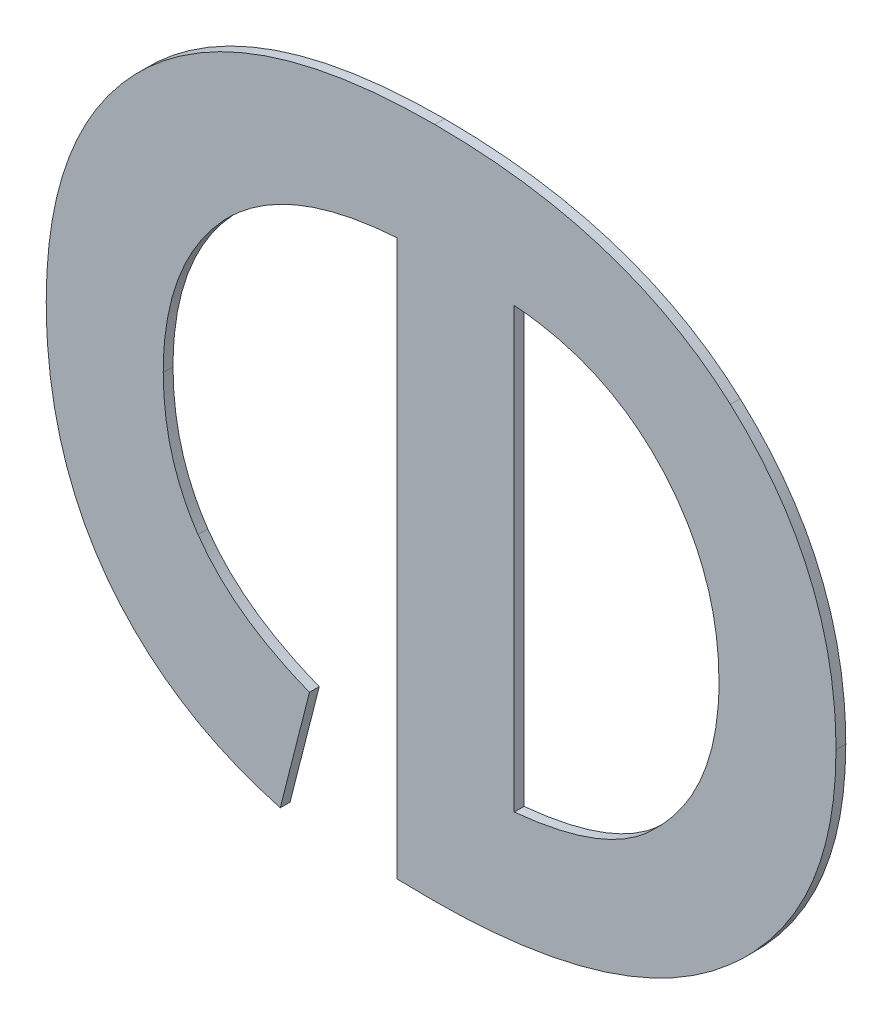
ISO-10303-21;
HEADER;
FILE_DESCRIPTION(('STEP AP214'),'2;1');
FILE_NAME('part.step','',(''),(''),'','','');
FILE_SCHEMA(('AUTOMOTIVE_DESIGN { 1 0 10303 214 1 1 1 1 }'));
ENDSEC;
DATA;
#1=APPLICATION_CONTEXT('core data for automotive mechanical design processes');
#2=APPLICATION_PROTOCOL_DEFINITION('international standard','automotive_design',2000,#1);
#3=PRODUCT_CONTEXT('',#1,'mechanical');
#4=PRODUCT('Part','Part','',(#3));
#5=PRODUCT_RELATED_PRODUCT_CATEGORY('part','',(#4));
#6=PRODUCT_DEFINITION_FORMATION('','',#4);
#7=PRODUCT_DEFINITION_CONTEXT('part definition',#1,'design');
#8=PRODUCT_DEFINITION('design','',#6,#7);
#9=PRODUCT_DEFINITION_SHAPE('','',#8);
#10=(LENGTH_UNIT() NAMED_UNIT(*) SI_UNIT(.MILLI.,.METRE.));
#11=(NAMED_UNIT(*) PLANE_ANGLE_UNIT() SI_UNIT($,.RADIAN.));
#12=(NAMED_UNIT(*) SI_UNIT($,.STERADIAN.) SOLID_ANGLE_UNIT());
#13=UNCERTAINTY_MEASURE_WITH_UNIT(LENGTH_MEASURE(1.E-05),#10,'distance_accuracy_value','');
#14=(GEOMETRIC_REPRESENTATION_CONTEXT(3) GLOBAL_UNCERTAINTY_ASSIGNED_CONTEXT((#13)) GLOBAL_UNIT_ASSIGNED_CONTEXT((#10,
#11,#12)) REPRESENTATION_CONTEXT('',''));
#15=CARTESIAN_POINT('',(0.,0.,0.));
#16=DIRECTION('',(0.,0.,1.));
#17=DIRECTION('',(1.,0.,0.));
#18=AXIS2_PLACEMENT_3D('',#15,#16,#17);
#19=CARTESIAN_POINT('',(1.095228086098,1.2951719650312,1.7496000059366));
#20=DIRECTION('',(0.968996414651314,-0.247074782996766,0.));
#21=DIRECTION('',(0.,0.,-1.));
#22=AXIS2_PLACEMENT_3D('',#19,#20,#21);
#23=PLANE('',#22);
#24=DIRECTION('',(0.,0.,1.));
#25=VECTOR('',#24,1.);
#26=CARTESIAN_POINT('',(1.0958259629557,1.2975167633327,1.7492000059366));
#27=LINE('',#26,#25);
#28=CARTESIAN_POINT('',(1.0958259629557,1.2975167633327,1.7492000059366));
#29=VERTEX_POINT('',#28);
#30=CARTESIAN_POINT('',(1.0958259629557,1.2975167633327,1.7496000059366));
#31=VERTEX_POINT('',#30);
#32=EDGE_CURVE('E11',#29,#31,#27,.T.);
#33=ORIENTED_EDGE('',*,*,#32,.T.);
#34=DIRECTION('',(-0.247074782996766,-0.968996414651314,0.));
#35=VECTOR('',#34,1.);
#36=CARTESIAN_POINT('',(1.0958259629557,1.2975167633327,1.7496000059366));
#37=LINE('',#36,#35);
#38=CARTESIAN_POINT('',(1.0946302092403,1.2928271667297,1.7496000059366));
#39=VERTEX_POINT('',#38);
#40=EDGE_CURVE('E24',#31,#39,#37,.T.);
#41=ORIENTED_EDGE('',*,*,#40,.T.);
#42=DIRECTION('',(0.,0.,1.));
#43=VECTOR('',#42,1.);
#44=CARTESIAN_POINT('',(1.0946302092403,1.2928271667297,1.7492000059366));
#45=LINE('',#44,#43);
#46=CARTESIAN_POINT('',(1.0946302092403,1.2928271667297,1.7492000059366));
#47=VERTEX_POINT('',#46);
#48=EDGE_CURVE('E482',#47,#39,#45,.T.);
#49=ORIENTED_EDGE('',*,*,#48,.F.);
#50=DIRECTION('',(-0.247074782996766,-0.968996414651314,0.));
#51=VECTOR('',#50,1.);
#52=CARTESIAN_POINT('',(1.0958259629557,1.2975167633327,1.7492000059366));
#53=LINE('',#52,#51);
#54=EDGE_CURVE('E476',#29,#47,#53,.T.);
#55=ORIENTED_EDGE('',*,*,#54,.F.);
#56=EDGE_LOOP('',(#33,#41,#49,#55));
#57=FACE_BOUND('',#56,.T.);
#58=ADVANCED_FACE('F17',(#57),#23,.T.);
#59=CARTESIAN_POINT('',(1.0946302092403,1.2928271667297,1.7496000059366));
#60=CARTESIAN_POINT('',(1.0946302092403,1.2928271667297,1.7491200059366));
#61=CARTESIAN_POINT('',(1.0900900818517,1.2940602877489,1.7496000059366));
#62=CARTESIAN_POINT('',(1.0900900818517,1.2940602877489,1.7491200059366));
#63=CARTESIAN_POINT('',(1.0875677888581,1.2974046614219,1.7496000059366));
#64=CARTESIAN_POINT('',(1.0875677888581,1.2974046614219,1.7491200059366));
#65=B_SPLINE_SURFACE_WITH_KNOTS('',2,1,((#59,#60),(#61,#62),(#63,#64)),.UNSPECIFIED.,.F.,.F.,
.F.,(3,3),(2,2),(0.,1.),(0.,0.000239999999999974),.UNSPECIFIED.);
#66=CARTESIAN_POINT('',(1.0946302092403,1.2928271667297,1.7496000059366));
#67=CARTESIAN_POINT('',(1.0900900818517,1.2940602877489,1.7496000059366));
#68=CARTESIAN_POINT('',(1.0875677888581,1.2974046614219,1.7496000059366));
#69=B_SPLINE_CURVE_WITH_KNOTS('',2,(#66,#67,#68),.UNSPECIFIED.,.F.,.F.,(3,3),(0.,1.),.UNSPECIFIED.);
#70=CARTESIAN_POINT('',(1.0875677888581,1.2974046614219,1.7496000059366));
#71=VERTEX_POINT('',#70);
#72=EDGE_CURVE('E472',#39,#71,#69,.T.);
#73=DIRECTION('',(0.,0.,1.));
#74=VECTOR('',#73,1.);
#75=CARTESIAN_POINT('',(1.0875677888581,1.2974046614219,1.7492000059366));
#76=LINE('',#75,#74);
#77=CARTESIAN_POINT('',(1.0875677888581,1.2974046614219,1.7492000059366));
#78=VERTEX_POINT('',#77);
#79=EDGE_CURVE('E466',#78,#71,#76,.T.);
#80=CARTESIAN_POINT('',(1.0946302092403,1.2928271667297,1.7492000059366));
#81=CARTESIAN_POINT('',(1.0900900818517,1.2940602877489,1.7492000059366));
#82=CARTESIAN_POINT('',(1.0875677888581,1.2974046614219,1.7492000059366));
#83=B_SPLINE_CURVE_WITH_KNOTS('',2,(#80,#81,#82),.UNSPECIFIED.,.F.,.F.,(3,3),(0.,1.),.UNSPECIFIED.);
#84=EDGE_CURVE('E458',#47,#78,#83,.T.);
#85=ORIENTED_EDGE('',*,*,#48,.T.);
#86=ORIENTED_EDGE('',*,*,#72,.T.);
#87=ORIENTED_EDGE('',*,*,#79,.F.);
#88=ORIENTED_EDGE('',*,*,#84,.F.);
#89=EDGE_LOOP('',(#85,#86,#87,#88));
#90=FACE_BOUND('',#89,.T.);
#91=ADVANCED_FACE('F489',(#90),#65,.T.);
#92=CARTESIAN_POINT('',(1.0875677888581,1.2974046614219,1.7496000059366));
#93=CARTESIAN_POINT('',(1.0875677888581,1.2974046614219,1.7491200059366));
#94=CARTESIAN_POINT('',(1.0850641795163,1.3007490350949,1.7496000059366));
#95=CARTESIAN_POINT('',(1.0850641795163,1.3007490350949,1.7491200059366));
#96=CARTESIAN_POINT('',(1.0850641795163,1.3059617739485,1.7496000059366));
#97=CARTESIAN_POINT('',(1.0850641795163,1.3059617739485,1.7491200059366));
#98=B_SPLINE_SURFACE_WITH_KNOTS('',2,1,((#92,#93),(#94,#95),(#96,#97)),.UNSPECIFIED.,.F.,.F.,
.F.,(3,3),(2,2),(0.,1.),(0.,0.000239999999999974),.UNSPECIFIED.);
#99=CARTESIAN_POINT('',(1.0875677888581,1.2974046614219,1.7496000059366));
#100=CARTESIAN_POINT('',(1.0850641795163,1.3007490350949,1.7496000059366));
#101=CARTESIAN_POINT('',(1.0850641795163,1.3059617739485,1.7496000059366));
#102=B_SPLINE_CURVE_WITH_KNOTS('',2,(#99,#100,#101),.UNSPECIFIED.,.F.,.F.,(3,3),(0.,1.),.UNSPECIFIED.);
#103=CARTESIAN_POINT('',(1.0850641795163,1.3059617739485,1.7496000059366));
#104=VERTEX_POINT('',#103);
#105=EDGE_CURVE('E454',#71,#104,#102,.T.);
#106=DIRECTION('',(0.,0.,1.));
#107=VECTOR('',#106,1.);
#108=CARTESIAN_POINT('',(1.0850641795163,1.3059617739485,1.7492000059366));
#109=LINE('',#108,#107);
#110=CARTESIAN_POINT('',(1.0850641795163,1.3059617739485,1.7492000059366));
#111=VERTEX_POINT('',#110);
#112=EDGE_CURVE('E448',#111,#104,#109,.T.);
#113=CARTESIAN_POINT('',(1.0875677888581,1.2974046614219,1.7492000059366));
#114=CARTESIAN_POINT('',(1.0850641795163,1.3007490350949,1.7492000059366));
#115=CARTESIAN_POINT('',(1.0850641795163,1.3059617739485,1.7492000059366));
#116=B_SPLINE_CURVE_WITH_KNOTS('',2,(#113,#114,#115),.UNSPECIFIED.,.F.,.F.,(3,3),(0.,1.),.UNSPECIFIED.);
#117=EDGE_CURVE('E440',#78,#111,#116,.T.);
#118=ORIENTED_EDGE('',*,*,#79,.T.);
#119=ORIENTED_EDGE('',*,*,#105,.T.);
#120=ORIENTED_EDGE('',*,*,#112,.F.);
#121=ORIENTED_EDGE('',*,*,#117,.F.);
#122=EDGE_LOOP('',(#118,#119,#120,#121));
#123=FACE_BOUND('',#122,.T.);
#124=ADVANCED_FACE('F496',(#123),#98,.T.);
#125=CARTESIAN_POINT('',(1.0850641795163,1.3059617739485,1.7496000059366));
#126=CARTESIAN_POINT('',(1.0850641795163,1.3059617739485,1.7491200059366));
#127=CARTESIAN_POINT('',(1.0850641795163,1.3125010520801,1.7496000059366));
#128=CARTESIAN_POINT('',(1.0850641795163,1.3125010520801,1.7491200059366));
#129=CARTESIAN_POINT('',(1.0892306338687,1.3163498843519,1.7496000059366));
#130=CARTESIAN_POINT('',(1.0892306338687,1.3163498843519,1.7491200059366));
#131=B_SPLINE_SURFACE_WITH_KNOTS('',2,1,((#125,#126),(#127,#128),(#129,#130)),.UNSPECIFIED.,.F.,
.F.,.F.,(3,3),(2,2),(0.,1.),(0.,0.000239999999999974),.UNSPECIFIED.);
#132=CARTESIAN_POINT('',(1.0850641795163,1.3059617739485,1.7496000059366));
#133=CARTESIAN_POINT('',(1.0850641795163,1.3125010520801,1.7496000059366));
#134=CARTESIAN_POINT('',(1.0892306338687,1.3163498843519,1.7496000059366));
#135=B_SPLINE_CURVE_WITH_KNOTS('',2,(#132,#133,#134),.UNSPECIFIED.,.F.,.F.,(3,3),(0.,1.),.UNSPECIFIED.);
#136=CARTESIAN_POINT('',(1.0892306338687,1.3163498843519,1.7496000059366));
#137=VERTEX_POINT('',#136);
#138=EDGE_CURVE('E436',#104,#137,#135,.T.);
#139=DIRECTION('',(0.,0.,1.));
#140=VECTOR('',#139,1.);
#141=CARTESIAN_POINT('',(1.0892306338687,1.3163498843519,1.7492000059366));
#142=LINE('',#141,#140);
#143=CARTESIAN_POINT('',(1.0892306338687,1.3163498843519,1.7492000059366));
#144=VERTEX_POINT('',#143);
#145=EDGE_CURVE('E430',#144,#137,#142,.T.);
#146=CARTESIAN_POINT('',(1.0850641795163,1.3059617739485,1.7492000059366));
#147=CARTESIAN_POINT('',(1.0850641795163,1.3125010520801,1.7492000059366));
#148=CARTESIAN_POINT('',(1.0892306338687,1.3163498843519,1.7492000059366));
#149=B_SPLINE_CURVE_WITH_KNOTS('',2,(#146,#147,#148),.UNSPECIFIED.,.F.,.F.,(3,3),(0.,1.),.UNSPECIFIED.);
#150=EDGE_CURVE('E422',#111,#144,#149,.T.);
#151=ORIENTED_EDGE('',*,*,#112,.T.);
#152=ORIENTED_EDGE('',*,*,#138,.T.);
#153=ORIENTED_EDGE('',*,*,#145,.F.);
#154=ORIENTED_EDGE('',*,*,#150,.F.);
#155=EDGE_LOOP('',(#151,#152,#153,#154));
#156=FACE_BOUND('',#155,.T.);
#157=ADVANCED_FACE('F500',(#156),#131,.T.);
#158=CARTESIAN_POINT('',(1.0892306338687,1.3163498843519,1.7496000059366));
#159=CARTESIAN_POINT('',(1.0892306338687,1.3163498843519,1.7491200059366));
#160=CARTESIAN_POINT('',(1.0934157718729,1.3201800329719,1.7496000059366));
#161=CARTESIAN_POINT('',(1.0934157718729,1.3201800329719,1.7491200059366));
#162=CARTESIAN_POINT('',(1.1009452835503,1.3201800329719,1.7496000059366));
#163=CARTESIAN_POINT('',(1.1009452835503,1.3201800329719,1.7491200059366));
#164=B_SPLINE_SURFACE_WITH_KNOTS('',2,1,((#158,#159),(#160,#161),(#162,#163)),.UNSPECIFIED.,.F.,
.F.,.F.,(3,3),(2,2),(0.,1.),(0.,0.000239999999999974),.UNSPECIFIED.);
#165=CARTESIAN_POINT('',(1.0892306338687,1.3163498843519,1.7496000059366));
#166=CARTESIAN_POINT('',(1.0934157718729,1.3201800329719,1.7496000059366));
#167=CARTESIAN_POINT('',(1.1009452835503,1.3201800329719,1.7496000059366));
#168=B_SPLINE_CURVE_WITH_KNOTS('',2,(#165,#166,#167),.UNSPECIFIED.,.F.,.F.,(3,3),(0.,1.),.UNSPECIFIED.);
#169=CARTESIAN_POINT('',(1.1009452835503,1.3201800329719,1.7496000059366));
#170=VERTEX_POINT('',#169);
#171=EDGE_CURVE('E418',#137,#170,#168,.T.);
#172=DIRECTION('',(0.,0.,1.));
#173=VECTOR('',#172,1.);
#174=CARTESIAN_POINT('',(1.1009452835503,1.3201800329719,1.7492000059366));
#175=LINE('',#174,#173);
#176=CARTESIAN_POINT('',(1.1009452835503,1.3201800329719,1.7492000059366));
#177=VERTEX_POINT('',#176);
#178=EDGE_CURVE('E412',#177,#170,#175,.T.);
#179=CARTESIAN_POINT('',(1.0892306338687,1.3163498843519,1.7492000059366));
#180=CARTESIAN_POINT('',(1.0934157718729,1.3201800329719,1.7492000059366));
#181=CARTESIAN_POINT('',(1.1009452835503,1.3201800329719,1.7492000059366));
#182=B_SPLINE_CURVE_WITH_KNOTS('',2,(#179,#180,#181),.UNSPECIFIED.,.F.,.F.,(3,3),(0.,1.),.UNSPECIFIED.);
#183=EDGE_CURVE('E404',#144,#177,#182,.T.);
#184=ORIENTED_EDGE('',*,*,#145,.T.);
#185=ORIENTED_EDGE('',*,*,#171,.T.);
#186=ORIENTED_EDGE('',*,*,#178,.F.);
#187=ORIENTED_EDGE('',*,*,#183,.F.);
#188=EDGE_LOOP('',(#184,#185,#186,#187));
#189=FACE_BOUND('',#188,.T.);
#190=ADVANCED_FACE('F505',(#189),#164,.T.);
#191=CARTESIAN_POINT('',(1.1009452835503,1.3201800329719,1.7496000059366));
#192=CARTESIAN_POINT('',(1.1009452835503,1.3201800329719,1.7491200059366));
#193=CARTESIAN_POINT('',(1.1087363663529,1.3201800329719,1.7496000059366));
#194=CARTESIAN_POINT('',(1.1087363663529,1.3201800329719,1.7491200059366));
#195=CARTESIAN_POINT('',(1.1130336062679,1.3163125170483,1.7496000059366));
#196=CARTESIAN_POINT('',(1.1130336062679,1.3163125170483,1.7491200059366));
#197=B_SPLINE_SURFACE_WITH_KNOTS('',2,1,((#191,#192),(#193,#194),(#195,#196)),.UNSPECIFIED.,.F.,
.F.,.F.,(3,3),(2,2),(0.,1.),(0.,0.000239999999999974),.UNSPECIFIED.);
#198=CARTESIAN_POINT('',(1.1009452835503,1.3201800329719,1.7496000059366));
#199=CARTESIAN_POINT('',(1.1087363663529,1.3201800329719,1.7496000059366));
#200=CARTESIAN_POINT('',(1.1130336062679,1.3163125170483,1.7496000059366));
#201=B_SPLINE_CURVE_WITH_KNOTS('',2,(#198,#199,#200),.UNSPECIFIED.,.F.,.F.,(3,3),(0.,1.),.UNSPECIFIED.);
#202=CARTESIAN_POINT('',(1.1130336062679,1.3163125170483,1.7496000059366));
#203=VERTEX_POINT('',#202);
#204=EDGE_CURVE('E400',#170,#203,#201,.T.);
#205=DIRECTION('',(0.,0.,1.));
#206=VECTOR('',#205,1.);
#207=CARTESIAN_POINT('',(1.1130336062679,1.3163125170483,1.7492000059366));
#208=LINE('',#207,#206);
#209=CARTESIAN_POINT('',(1.1130336062679,1.3163125170483,1.7492000059366));
#210=VERTEX_POINT('',#209);
#211=EDGE_CURVE('E394',#210,#203,#208,.T.);
#212=CARTESIAN_POINT('',(1.1009452835503,1.3201800329719,1.7492000059366));
#213=CARTESIAN_POINT('',(1.1087363663529,1.3201800329719,1.7492000059366));
#214=CARTESIAN_POINT('',(1.1130336062679,1.3163125170483,1.7492000059366));
#215=B_SPLINE_CURVE_WITH_KNOTS('',2,(#212,#213,#214),.UNSPECIFIED.,.F.,.F.,(3,3),(0.,1.),.UNSPECIFIED.);
#216=EDGE_CURVE('E386',#177,#210,#215,.T.);
#217=ORIENTED_EDGE('',*,*,#178,.T.);
#218=ORIENTED_EDGE('',*,*,#204,.T.);
#219=ORIENTED_EDGE('',*,*,#211,.F.);
#220=ORIENTED_EDGE('',*,*,#216,.F.);
#221=EDGE_LOOP('',(#217,#218,#219,#220));
#222=FACE_BOUND('',#221,.T.);
#223=ADVANCED_FACE('F508',(#222),#197,.T.);
#224=CARTESIAN_POINT('',(1.1130336062679,1.3163125170483,1.7496000059366));
#225=CARTESIAN_POINT('',(1.1130336062679,1.3163125170483,1.7491200059366));
#226=CARTESIAN_POINT('',(1.1173495298347,1.3124263174729,1.7496000059366));
#227=CARTESIAN_POINT('',(1.1173495298347,1.3124263174729,1.7491200059366));
#228=CARTESIAN_POINT('',(1.1173495298347,1.3062420287255,1.7496000059366));
#229=CARTESIAN_POINT('',(1.1173495298347,1.3062420287255,1.7491200059366));
#230=B_SPLINE_SURFACE_WITH_KNOTS('',2,1,((#224,#225),(#226,#227),(#228,#229)),.UNSPECIFIED.,.F.,
.F.,.F.,(3,3),(2,2),(0.,1.),(0.,0.000239999999999974),.UNSPECIFIED.);
#231=CARTESIAN_POINT('',(1.1130336062679,1.3163125170483,1.7496000059366));
#232=CARTESIAN_POINT('',(1.1173495298347,1.3124263174729,1.7496000059366));
#233=CARTESIAN_POINT('',(1.1173495298347,1.3062420287255,1.7496000059366));
#234=B_SPLINE_CURVE_WITH_KNOTS('',2,(#231,#232,#233),.UNSPECIFIED.,.F.,.F.,(3,3),(0.,1.),.UNSPECIFIED.);
#235=CARTESIAN_POINT('',(1.1173495298347,1.3062420287255,1.7496000059366));
#236=VERTEX_POINT('',#235);
#237=EDGE_CURVE('E382',#203,#236,#234,.T.);
#238=DIRECTION('',(0.,0.,1.));
#239=VECTOR('',#238,1.);
#240=CARTESIAN_POINT('',(1.1173495298347,1.3062420287255,1.7492000059366));
#241=LINE('',#240,#239);
#242=CARTESIAN_POINT('',(1.1173495298347,1.3062420287255,1.7492000059366));
#243=VERTEX_POINT('',#242);
#244=EDGE_CURVE('E376',#243,#236,#241,.T.);
#245=CARTESIAN_POINT('',(1.1130336062679,1.3163125170483,1.7492000059366));
#246=CARTESIAN_POINT('',(1.1173495298347,1.3124263174729,1.7492000059366));
#247=CARTESIAN_POINT('',(1.1173495298347,1.3062420287255,1.7492000059366));
#248=B_SPLINE_CURVE_WITH_KNOTS('',2,(#245,#246,#247),.UNSPECIFIED.,.F.,.F.,(3,3),(0.,1.),.UNSPECIFIED.);
#249=EDGE_CURVE('E368',#210,#243,#248,.T.);
#250=ORIENTED_EDGE('',*,*,#211,.T.);
#251=ORIENTED_EDGE('',*,*,#237,.T.);
#252=ORIENTED_EDGE('',*,*,#244,.F.);
#253=ORIENTED_EDGE('',*,*,#249,.F.);
#254=EDGE_LOOP('',(#250,#251,#252,#253));
#255=FACE_BOUND('',#254,.T.);
#256=ADVANCED_FACE('F513',(#255),#230,.T.);
#257=CARTESIAN_POINT('',(1.1173495298347,1.3062420287255,1.7496000059366));
#258=CARTESIAN_POINT('',(1.1173495298347,1.3062420287255,1.7491200059366));
#259=CARTESIAN_POINT('',(1.1173495298347,1.3002632601481,1.7496000059366));
#260=CARTESIAN_POINT('',(1.1173495298347,1.3002632601481,1.7491200059366));
#261=CARTESIAN_POINT('',(1.1130149226161,1.2964704788317,1.7496000059366));
#262=CARTESIAN_POINT('',(1.1130149226161,1.2964704788317,1.7491200059366));
#263=B_SPLINE_SURFACE_WITH_KNOTS('',2,1,((#257,#258),(#259,#260),(#261,#262)),.UNSPECIFIED.,.F.,
.F.,.F.,(3,3),(2,2),(0.,1.),(0.,0.000239999999999974),.UNSPECIFIED.);
#264=CARTESIAN_POINT('',(1.1173495298347,1.3062420287255,1.7496000059366));
#265=CARTESIAN_POINT('',(1.1173495298347,1.3002632601481,1.7496000059366));
#266=CARTESIAN_POINT('',(1.1130149226161,1.2964704788317,1.7496000059366));
#267=B_SPLINE_CURVE_WITH_KNOTS('',2,(#264,#265,#266),.UNSPECIFIED.,.F.,.F.,(3,3),(0.,1.),.UNSPECIFIED.);
#268=CARTESIAN_POINT('',(1.1130149226161,1.2964704788317,1.7496000059366));
#269=VERTEX_POINT('',#268);
#270=EDGE_CURVE('E364',#236,#269,#267,.T.);
#271=DIRECTION('',(0.,0.,1.));
#272=VECTOR('',#271,1.);
#273=CARTESIAN_POINT('',(1.1130149226161,1.2964704788317,1.7492000059366));
#274=LINE('',#273,#272);
#275=CARTESIAN_POINT('',(1.1130149226161,1.2964704788317,1.7492000059366));
#276=VERTEX_POINT('',#275);
#277=EDGE_CURVE('E358',#276,#269,#274,.T.);
#278=CARTESIAN_POINT('',(1.1173495298347,1.3062420287255,1.7492000059366));
#279=CARTESIAN_POINT('',(1.1173495298347,1.3002632601481,1.7492000059366));
#280=CARTESIAN_POINT('',(1.1130149226161,1.2964704788317,1.7492000059366));
#281=B_SPLINE_CURVE_WITH_KNOTS('',2,(#278,#279,#280),.UNSPECIFIED.,.F.,.F.,(3,3),(0.,1.),.UNSPECIFIED.);
#282=EDGE_CURVE('E350',#243,#276,#281,.T.);
#283=ORIENTED_EDGE('',*,*,#244,.T.);
#284=ORIENTED_EDGE('',*,*,#270,.T.);
#285=ORIENTED_EDGE('',*,*,#277,.F.);
#286=ORIENTED_EDGE('',*,*,#282,.F.);
#287=EDGE_LOOP('',(#283,#284,#285,#286));
#288=FACE_BOUND('',#287,.T.);
#289=ADVANCED_FACE('F517',(#288),#263,.T.);
#290=CARTESIAN_POINT('',(1.1130149226161,1.2964704788317,1.7496000059366));
#291=CARTESIAN_POINT('',(1.1130149226161,1.2964704788317,1.7491200059366));
#292=CARTESIAN_POINT('',(1.1086989990493,1.2926776975153,1.7496000059366));
#293=CARTESIAN_POINT('',(1.1086989990493,1.2926776975153,1.7491200059366));
#294=CARTESIAN_POINT('',(1.1008518652913,1.2926776975153,1.7496000059366));
#295=CARTESIAN_POINT('',(1.1008518652913,1.2926776975153,1.7491200059366));
#296=B_SPLINE_SURFACE_WITH_KNOTS('',2,1,((#290,#291),(#292,#293),(#294,#295)),.UNSPECIFIED.,.F.,
.F.,.F.,(3,3),(2,2),(0.,1.),(0.,0.000239999999999974),.UNSPECIFIED.);
#297=CARTESIAN_POINT('',(1.1130149226161,1.2964704788317,1.7496000059366));
#298=CARTESIAN_POINT('',(1.1086989990493,1.2926776975153,1.7496000059366));
#299=CARTESIAN_POINT('',(1.1008518652913,1.2926776975153,1.7496000059366));
#300=B_SPLINE_CURVE_WITH_KNOTS('',2,(#297,#298,#299),.UNSPECIFIED.,.F.,.F.,(3,3),(0.,1.),.UNSPECIFIED.);
#301=CARTESIAN_POINT('',(1.1008518652913,1.2926776975153,1.7496000059366));
#302=VERTEX_POINT('',#301);
#303=EDGE_CURVE('E346',#269,#302,#300,.T.);
#304=DIRECTION('',(0.,0.,1.));
#305=VECTOR('',#304,1.);
#306=CARTESIAN_POINT('',(1.1008518652913,1.2926776975153,1.7492000059366));
#307=LINE('',#306,#305);
#308=CARTESIAN_POINT('',(1.1008518652913,1.2926776975153,1.7492000059366));
#309=VERTEX_POINT('',#308);
#310=EDGE_CURVE('E340',#309,#302,#307,.T.);
#311=CARTESIAN_POINT('',(1.1130149226161,1.2964704788317,1.7492000059366));
#312=CARTESIAN_POINT('',(1.1086989990493,1.2926776975153,1.7492000059366));
#313=CARTESIAN_POINT('',(1.1008518652913,1.2926776975153,1.7492000059366));
#314=B_SPLINE_CURVE_WITH_KNOTS('',2,(#311,#312,#313),.UNSPECIFIED.,.F.,.F.,(3,3),(0.,1.),.UNSPECIFIED.);
#315=EDGE_CURVE('E332',#276,#309,#314,.T.);
#316=ORIENTED_EDGE('',*,*,#277,.T.);
#317=ORIENTED_EDGE('',*,*,#303,.T.);
#318=ORIENTED_EDGE('',*,*,#310,.F.);
#319=ORIENTED_EDGE('',*,*,#315,.F.);
#320=EDGE_LOOP('',(#316,#317,#318,#319));
#321=FACE_BOUND('',#320,.T.);
#322=ADVANCED_FACE('F521',(#321),#296,.T.);
#323=CARTESIAN_POINT('',(1.1008518652913,1.2926776975153,1.7496000059366));
#324=CARTESIAN_POINT('',(1.1008518652913,1.2926776975153,1.7491200059366));
#325=CARTESIAN_POINT('',(1.1003660903443,1.2926776975153,1.7496000059366));
#326=CARTESIAN_POINT('',(1.1003660903443,1.2926776975153,1.7491200059366));
#327=CARTESIAN_POINT('',(1.0994132241023,1.2926963811671,1.7496000059366));
#328=CARTESIAN_POINT('',(1.0994132241023,1.2926963811671,1.7491200059366));
#329=B_SPLINE_SURFACE_WITH_KNOTS('',2,1,((#323,#324),(#325,#326),(#327,#328)),.UNSPECIFIED.,.F.,
.F.,.F.,(3,3),(2,2),(0.,1.),(0.,0.000239999999999974),.UNSPECIFIED.);
#330=CARTESIAN_POINT('',(1.1008518652913,1.2926776975153,1.7496000059366));
#331=CARTESIAN_POINT('',(1.1003660903443,1.2926776975153,1.7496000059366));
#332=CARTESIAN_POINT('',(1.0994132241023,1.2926963811671,1.7496000059366));
#333=B_SPLINE_CURVE_WITH_KNOTS('',2,(#330,#331,#332),.UNSPECIFIED.,.F.,.F.,(3,3),(0.,1.),.UNSPECIFIED.);
#334=CARTESIAN_POINT('',(1.0994132241023,1.2926963811671,1.7496000059366));
#335=VERTEX_POINT('',#334);
#336=EDGE_CURVE('E328',#302,#335,#333,.T.);
#337=DIRECTION('',(0.,0.,1.));
#338=VECTOR('',#337,1.);
#339=CARTESIAN_POINT('',(1.0994132241023,1.2926963811671,1.7492000059366));
#340=LINE('',#339,#338);
#341=CARTESIAN_POINT('',(1.0994132241023,1.2926963811671,1.7492000059366));
#342=VERTEX_POINT('',#341);
#343=EDGE_CURVE('E322',#342,#335,#340,.T.);
#344=CARTESIAN_POINT('',(1.1008518652913,1.2926776975153,1.7492000059366));
#345=CARTESIAN_POINT('',(1.1003660903443,1.2926776975153,1.7492000059366));
#346=CARTESIAN_POINT('',(1.0994132241023,1.2926963811671,1.7492000059366));
#347=B_SPLINE_CURVE_WITH_KNOTS('',2,(#344,#345,#346),.UNSPECIFIED.,.F.,.F.,(3,3),(0.,1.),.UNSPECIFIED.);
#348=EDGE_CURVE('E317',#309,#342,#347,.T.);
#349=ORIENTED_EDGE('',*,*,#310,.T.);
#350=ORIENTED_EDGE('',*,*,#336,.T.);
#351=ORIENTED_EDGE('',*,*,#343,.F.);
#352=ORIENTED_EDGE('',*,*,#348,.F.);
#353=EDGE_LOOP('',(#349,#350,#351,#352));
#354=FACE_BOUND('',#353,.T.);
#355=ADVANCED_FACE('F524',(#354),#329,.T.);
#356=CARTESIAN_POINT('',(1.0994132241023,1.3040466996385,1.7496000059366));
#357=DIRECTION('',(-1.,0.,0.));
#358=DIRECTION('',(0.,0.,1.));
#359=AXIS2_PLACEMENT_3D('',#356,#357,#358);
#360=PLANE('',#359);
#361=ORIENTED_EDGE('',*,*,#343,.T.);
#362=DIRECTION('',(0.,1.,0.));
#363=VECTOR('',#362,1.);
#364=CARTESIAN_POINT('',(1.0994132241023,1.2926963811671,1.7496000059366));
#365=LINE('',#364,#363);
#366=CARTESIAN_POINT('',(1.0994132241023,1.3153970181099,1.7496000059366));
#367=VERTEX_POINT('',#366);
#368=EDGE_CURVE('E315',#335,#367,#365,.T.);
#369=ORIENTED_EDGE('',*,*,#368,.T.);
#370=DIRECTION('',(0.,0.,1.));
#371=VECTOR('',#370,1.);
#372=CARTESIAN_POINT('',(1.0994132241023,1.3153970181099,1.7492000059366));
#373=LINE('',#372,#371);
#374=CARTESIAN_POINT('',(1.0994132241023,1.3153970181099,1.7492000059366));
#375=VERTEX_POINT('',#374);
#376=EDGE_CURVE('E312',#375,#367,#373,.T.);
#377=ORIENTED_EDGE('',*,*,#376,.F.);
#378=DIRECTION('',(0.,1.,0.));
#379=VECTOR('',#378,1.);
#380=CARTESIAN_POINT('',(1.0994132241023,1.2926963811671,1.7492000059366));
#381=LINE('',#380,#379);
#382=EDGE_CURVE('E306',#342,#375,#381,.T.);
#383=ORIENTED_EDGE('',*,*,#382,.F.);
#384=EDGE_LOOP('',(#361,#369,#377,#383));
#385=FACE_BOUND('',#384,.T.);
#386=ADVANCED_FACE('F529',(#385),#360,.T.);
#387=CARTESIAN_POINT('',(1.0994132241023,1.3153970181099,1.7496000059366));
#388=CARTESIAN_POINT('',(1.0994132241023,1.3153970181099,1.7491200059366));
#389=CARTESIAN_POINT('',(1.0947796784547,1.3150980796809,1.7496000059366));
#390=CARTESIAN_POINT('',(1.0947796784547,1.3150980796809,1.7491200059366));
#391=CARTESIAN_POINT('',(1.0923134364165,1.3124636847765,1.7496000059366));
#392=CARTESIAN_POINT('',(1.0923134364165,1.3124636847765,1.7491200059366));
#393=B_SPLINE_SURFACE_WITH_KNOTS('',2,1,((#387,#388),(#389,#390),(#391,#392)),.UNSPECIFIED.,.F.,
.F.,.F.,(3,3),(2,2),(0.,1.),(0.,0.000239999999999974),.UNSPECIFIED.);
#394=CARTESIAN_POINT('',(1.0994132241023,1.3153970181099,1.7496000059366));
#395=CARTESIAN_POINT('',(1.0947796784547,1.3150980796809,1.7496000059366));
#396=CARTESIAN_POINT('',(1.0923134364165,1.3124636847765,1.7496000059366));
#397=B_SPLINE_CURVE_WITH_KNOTS('',2,(#394,#395,#396),.UNSPECIFIED.,.F.,.F.,(3,3),(0.,1.),.UNSPECIFIED.);
#398=CARTESIAN_POINT('',(1.0923134364165,1.3124636847765,1.7496000059366));
#399=VERTEX_POINT('',#398);
#400=EDGE_CURVE('E302',#367,#399,#397,.T.);
#401=DIRECTION('',(0.,0.,1.));
#402=VECTOR('',#401,1.);
#403=CARTESIAN_POINT('',(1.0923134364165,1.3124636847765,1.7492000059366));
#404=LINE('',#403,#402);
#405=CARTESIAN_POINT('',(1.0923134364165,1.3124636847765,1.7492000059366));
#406=VERTEX_POINT('',#405);
#407=EDGE_CURVE('E296',#406,#399,#404,.T.);
#408=CARTESIAN_POINT('',(1.0994132241023,1.3153970181099,1.7492000059366));
#409=CARTESIAN_POINT('',(1.0947796784547,1.3150980796809,1.7492000059366));
#410=CARTESIAN_POINT('',(1.0923134364165,1.3124636847765,1.7492000059366));
#411=B_SPLINE_CURVE_WITH_KNOTS('',2,(#408,#409,#410),.UNSPECIFIED.,.F.,.F.,(3,3),(0.,1.),.UNSPECIFIED.);
#412=EDGE_CURVE('E288',#375,#406,#411,.T.);
#413=ORIENTED_EDGE('',*,*,#376,.T.);
#414=ORIENTED_EDGE('',*,*,#400,.T.);
#415=ORIENTED_EDGE('',*,*,#407,.F.);
#416=ORIENTED_EDGE('',*,*,#412,.F.);
#417=EDGE_LOOP('',(#413,#414,#415,#416));
#418=FACE_BOUND('',#417,.T.);
#419=ADVANCED_FACE('F533',(#418),#393,.T.);
#420=CARTESIAN_POINT('',(1.0923134364165,1.3124636847765,1.7496000059366));
#421=CARTESIAN_POINT('',(1.0923134364165,1.3124636847765,1.7491200059366));
#422=CARTESIAN_POINT('',(1.0898471943783,1.3098106062203,1.7496000059366));
#423=CARTESIAN_POINT('',(1.0898471943783,1.3098106062203,1.7491200059366));
#424=CARTESIAN_POINT('',(1.0898471943783,1.3058496720377,1.7496000059366));
#425=CARTESIAN_POINT('',(1.0898471943783,1.3058496720377,1.7491200059366));
#426=B_SPLINE_SURFACE_WITH_KNOTS('',2,1,((#420,#421),(#422,#423),(#424,#425)),.UNSPECIFIED.,.F.,
.F.,.F.,(3,3),(2,2),(0.,1.),(0.,0.000239999999999974),.UNSPECIFIED.);
#427=CARTESIAN_POINT('',(1.0923134364165,1.3124636847765,1.7496000059366));
#428=CARTESIAN_POINT('',(1.0898471943783,1.3098106062203,1.7496000059366));
#429=CARTESIAN_POINT('',(1.0898471943783,1.3058496720377,1.7496000059366));
#430=B_SPLINE_CURVE_WITH_KNOTS('',2,(#427,#428,#429),.UNSPECIFIED.,.F.,.F.,(3,3),(0.,1.),.UNSPECIFIED.);
#431=CARTESIAN_POINT('',(1.0898471943783,1.3058496720377,1.7496000059366));
#432=VERTEX_POINT('',#431);
#433=EDGE_CURVE('E284',#399,#432,#430,.T.);
#434=DIRECTION('',(0.,0.,1.));
#435=VECTOR('',#434,1.);
#436=CARTESIAN_POINT('',(1.0898471943783,1.3058496720377,1.7492000059366));
#437=LINE('',#436,#435);
#438=CARTESIAN_POINT('',(1.0898471943783,1.3058496720377,1.7492000059366));
#439=VERTEX_POINT('',#438);
#440=EDGE_CURVE('E278',#439,#432,#437,.T.);
#441=CARTESIAN_POINT('',(1.0923134364165,1.3124636847765,1.7492000059366));
#442=CARTESIAN_POINT('',(1.0898471943783,1.3098106062203,1.7492000059366));
#443=CARTESIAN_POINT('',(1.0898471943783,1.3058496720377,1.7492000059366));
#444=B_SPLINE_CURVE_WITH_KNOTS('',2,(#441,#442,#443),.UNSPECIFIED.,.F.,.F.,(3,3),(0.,1.),.UNSPECIFIED.);
#445=EDGE_CURVE('E270',#406,#439,#444,.T.);
#446=ORIENTED_EDGE('',*,*,#407,.T.);
#447=ORIENTED_EDGE('',*,*,#433,.T.);
#448=ORIENTED_EDGE('',*,*,#440,.F.);
#449=ORIENTED_EDGE('',*,*,#445,.F.);
#450=EDGE_LOOP('',(#446,#447,#448,#449));
#451=FACE_BOUND('',#450,.T.);
#452=ADVANCED_FACE('F537',(#451),#426,.T.);
#453=CARTESIAN_POINT('',(1.0898471943783,1.3058496720377,1.7496000059366));
#454=CARTESIAN_POINT('',(1.0898471943783,1.3058496720377,1.7491200059366));
#455=CARTESIAN_POINT('',(1.0898471943783,1.3028976550525,1.7496000059366));
#456=CARTESIAN_POINT('',(1.0898471943783,1.3028976550525,1.7491200059366));
#457=CARTESIAN_POINT('',(1.0912671519155,1.3008237697021,1.7496000059366));
#458=CARTESIAN_POINT('',(1.0912671519155,1.3008237697021,1.7491200059366));
#459=B_SPLINE_SURFACE_WITH_KNOTS('',2,1,((#453,#454),(#455,#456),(#457,#458)),.UNSPECIFIED.,.F.,
.F.,.F.,(3,3),(2,2),(0.,1.),(0.,0.000239999999999974),.UNSPECIFIED.);
#460=CARTESIAN_POINT('',(1.0898471943783,1.3058496720377,1.7496000059366));
#461=CARTESIAN_POINT('',(1.0898471943783,1.3028976550525,1.7496000059366));
#462=CARTESIAN_POINT('',(1.0912671519155,1.3008237697021,1.7496000059366));
#463=B_SPLINE_CURVE_WITH_KNOTS('',2,(#460,#461,#462),.UNSPECIFIED.,.F.,.F.,(3,3),(0.,1.),.UNSPECIFIED.);
#464=CARTESIAN_POINT('',(1.0912671519155,1.3008237697021,1.7496000059366));
#465=VERTEX_POINT('',#464);
#466=EDGE_CURVE('E266',#432,#465,#463,.T.);
#467=DIRECTION('',(0.,0.,1.));
#468=VECTOR('',#467,1.);
#469=CARTESIAN_POINT('',(1.0912671519155,1.3008237697021,1.7492000059366));
#470=LINE('',#469,#468);
#471=CARTESIAN_POINT('',(1.0912671519155,1.3008237697021,1.7492000059366));
#472=VERTEX_POINT('',#471);
#473=EDGE_CURVE('E260',#472,#465,#470,.T.);
#474=CARTESIAN_POINT('',(1.0898471943783,1.3058496720377,1.7492000059366));
#475=CARTESIAN_POINT('',(1.0898471943783,1.3028976550525,1.7492000059366));
#476=CARTESIAN_POINT('',(1.0912671519155,1.3008237697021,1.7492000059366));
#477=B_SPLINE_CURVE_WITH_KNOTS('',2,(#474,#475,#476),.UNSPECIFIED.,.F.,.F.,(3,3),(0.,1.),.UNSPECIFIED.);
#478=EDGE_CURVE('E252',#439,#472,#477,.T.);
#479=ORIENTED_EDGE('',*,*,#440,.T.);
#480=ORIENTED_EDGE('',*,*,#466,.T.);
#481=ORIENTED_EDGE('',*,*,#473,.F.);
#482=ORIENTED_EDGE('',*,*,#478,.F.);
#483=EDGE_LOOP('',(#479,#480,#481,#482));
#484=FACE_BOUND('',#483,.T.);
#485=ADVANCED_FACE('F540',(#484),#459,.T.);
#486=CARTESIAN_POINT('',(1.0912671519155,1.3008237697021,1.7496000059366));
#487=CARTESIAN_POINT('',(1.0912671519155,1.3008237697021,1.7491200059366));
#488=CARTESIAN_POINT('',(1.0927057931045,1.2987312007001,1.7496000059366));
#489=CARTESIAN_POINT('',(1.0927057931045,1.2987312007001,1.7491200059366));
#490=CARTESIAN_POINT('',(1.0958259629557,1.2975167633327,1.7496000059366));
#491=CARTESIAN_POINT('',(1.0958259629557,1.2975167633327,1.7491200059366));
#492=B_SPLINE_SURFACE_WITH_KNOTS('',2,1,((#486,#487),(#488,#489),(#490,#491)),.UNSPECIFIED.,.F.,
.F.,.F.,(3,3),(2,2),(0.,1.),(0.,0.000239999999999974),.UNSPECIFIED.);
#493=CARTESIAN_POINT('',(1.0912671519155,1.3008237697021,1.7496000059366));
#494=CARTESIAN_POINT('',(1.0927057931045,1.2987312007001,1.7496000059366));
#495=CARTESIAN_POINT('',(1.0958259629557,1.2975167633327,1.7496000059366));
#496=B_SPLINE_CURVE_WITH_KNOTS('',2,(#493,#494,#495),.UNSPECIFIED.,.F.,.F.,(3,3),(0.,1.),.UNSPECIFIED.);
#497=EDGE_CURVE('E245',#465,#31,#496,.T.);
#498=CARTESIAN_POINT('',(1.0912671519155,1.3008237697021,1.7492000059366));
#499=CARTESIAN_POINT('',(1.0927057931045,1.2987312007001,1.7492000059366));
#500=CARTESIAN_POINT('',(1.0958259629557,1.2975167633327,1.7492000059366));
#501=B_SPLINE_CURVE_WITH_KNOTS('',2,(#498,#499,#500),.UNSPECIFIED.,.F.,.F.,(3,3),(0.,1.),.UNSPECIFIED.);
#502=EDGE_CURVE('E240',#472,#29,#501,.T.);
#503=ORIENTED_EDGE('',*,*,#473,.T.);
#504=ORIENTED_EDGE('',*,*,#497,.T.);
#505=ORIENTED_EDGE('',*,*,#32,.F.);
#506=ORIENTED_EDGE('',*,*,#502,.F.);
#507=EDGE_LOOP('',(#503,#504,#505,#506));
#508=FACE_BOUND('',#507,.T.);
#509=ADVANCED_FACE('F541',(#508),#492,.T.);
#510=CARTESIAN_POINT('',(1.1041962389643,1.3064288652436,1.7496000059366));
#511=DIRECTION('',(1.,0.,0.));
#512=DIRECTION('',(0.,0.,-1.));
#513=AXIS2_PLACEMENT_3D('',#510,#511,#512);
#514=PLANE('',#513);
#515=DIRECTION('',(0.,0.,1.));
#516=VECTOR('',#515,1.);
#517=CARTESIAN_POINT('',(1.1041962389643,1.3153970181099,1.7492000059366));
#518=LINE('',#517,#516);
#519=CARTESIAN_POINT('',(1.1041962389643,1.3153970181099,1.7492000059366));
#520=VERTEX_POINT('',#519);
#521=CARTESIAN_POINT('',(1.1041962389643,1.3153970181099,1.7496000059366));
#522=VERTEX_POINT('',#521);
#523=EDGE_CURVE('E174',#520,#522,#518,.T.);
#524=ORIENTED_EDGE('',*,*,#523,.T.);
#525=DIRECTION('',(0.,-1.,0.));
#526=VECTOR('',#525,1.);
#527=CARTESIAN_POINT('',(1.1041962389643,1.3153970181099,1.7496000059366));
#528=LINE('',#527,#526);
#529=CARTESIAN_POINT('',(1.1041962389643,1.2974607123773,1.7496000059366));
#530=VERTEX_POINT('',#529);
#531=EDGE_CURVE('E237',#522,#530,#528,.T.);
#532=ORIENTED_EDGE('',*,*,#531,.T.);
#533=DIRECTION('',(0.,0.,1.));
#534=VECTOR('',#533,1.);
#535=CARTESIAN_POINT('',(1.1041962389643,1.2974607123773,1.7492000059366));
#536=LINE('',#535,#534);
#537=CARTESIAN_POINT('',(1.1041962389643,1.2974607123773,1.7492000059366));
#538=VERTEX_POINT('',#537);
#539=EDGE_CURVE('E234',#538,#530,#536,.T.);
#540=ORIENTED_EDGE('',*,*,#539,.F.);
#541=DIRECTION('',(0.,-1.,0.));
#542=VECTOR('',#541,1.);
#543=CARTESIAN_POINT('',(1.1041962389643,1.3153970181099,1.7492000059366));
#544=LINE('',#543,#542);
#545=EDGE_CURVE('E229',#520,#538,#544,.T.);
#546=ORIENTED_EDGE('',*,*,#545,.F.);
#547=EDGE_LOOP('',(#524,#532,#540,#546));
#548=FACE_BOUND('',#547,.T.);
#549=ADVANCED_FACE('F543',(#548),#514,.T.);
#550=CARTESIAN_POINT('',(1.1041962389643,1.2974607123773,1.7496000059366));
#551=CARTESIAN_POINT('',(1.1041962389643,1.2974607123773,1.7491200059366));
#552=CARTESIAN_POINT('',(1.1078769183699,1.2978157017617,1.7496000059366));
#553=CARTESIAN_POINT('',(1.1078769183699,1.2978157017617,1.7491200059366));
#554=CARTESIAN_POINT('',(1.1097079162467,1.2995159140759,1.7496000059366));
#555=CARTESIAN_POINT('',(1.1097079162467,1.2995159140759,1.7491200059366));
#556=B_SPLINE_SURFACE_WITH_KNOTS('',2,1,((#550,#551),(#552,#553),(#554,#555)),.UNSPECIFIED.,.F.,
.F.,.F.,(3,3),(2,2),(0.,1.),(0.,0.000239999999999974),.UNSPECIFIED.);
#557=CARTESIAN_POINT('',(1.1041962389643,1.2974607123773,1.7496000059366));
#558=CARTESIAN_POINT('',(1.1078769183699,1.2978157017617,1.7496000059366));
#559=CARTESIAN_POINT('',(1.1097079162467,1.2995159140759,1.7496000059366));
#560=B_SPLINE_CURVE_WITH_KNOTS('',2,(#557,#558,#559),.UNSPECIFIED.,.F.,.F.,(3,3),(0.,1.),.UNSPECIFIED.);
#561=CARTESIAN_POINT('',(1.1097079162467,1.2995159140759,1.7496000059366));
#562=VERTEX_POINT('',#561);
#563=EDGE_CURVE('E225',#530,#562,#560,.T.);
#564=DIRECTION('',(0.,0.,1.));
#565=VECTOR('',#564,1.);
#566=CARTESIAN_POINT('',(1.1097079162467,1.2995159140759,1.7492000059366));
#567=LINE('',#566,#565);
#568=CARTESIAN_POINT('',(1.1097079162467,1.2995159140759,1.7492000059366));
#569=VERTEX_POINT('',#568);
#570=EDGE_CURVE('E219',#569,#562,#567,.T.);
#571=CARTESIAN_POINT('',(1.1041962389643,1.2974607123773,1.7492000059366));
#572=CARTESIAN_POINT('',(1.1078769183699,1.2978157017617,1.7492000059366));
#573=CARTESIAN_POINT('',(1.1097079162467,1.2995159140759,1.7492000059366));
#574=B_SPLINE_CURVE_WITH_KNOTS('',2,(#571,#572,#573),.UNSPECIFIED.,.F.,.F.,(3,3),(0.,1.),.UNSPECIFIED.);
#575=EDGE_CURVE('E212',#538,#569,#574,.T.);
#576=ORIENTED_EDGE('',*,*,#539,.T.);
#577=ORIENTED_EDGE('',*,*,#563,.T.);
#578=ORIENTED_EDGE('',*,*,#570,.F.);
#579=ORIENTED_EDGE('',*,*,#575,.F.);
#580=EDGE_LOOP('',(#576,#577,#578,#579));
#581=FACE_BOUND('',#580,.T.);
#582=ADVANCED_FACE('F550',(#581),#556,.T.);
#583=CARTESIAN_POINT('',(1.1097079162467,1.2995159140759,1.7496000059366));
#584=CARTESIAN_POINT('',(1.1097079162467,1.2995159140759,1.7491200059366));
#585=CARTESIAN_POINT('',(1.1125665149727,1.3021129416767,1.7496000059366));
#586=CARTESIAN_POINT('',(1.1125665149727,1.3021129416767,1.7491200059366));
#587=CARTESIAN_POINT('',(1.1125665149727,1.3062607123773,1.7496000059366));
#588=CARTESIAN_POINT('',(1.1125665149727,1.3062607123773,1.7491200059366));
#589=B_SPLINE_SURFACE_WITH_KNOTS('',2,1,((#583,#584),(#585,#586),(#587,#588)),.UNSPECIFIED.,.F.,
.F.,.F.,(3,3),(2,2),(0.,1.),(0.,0.000239999999999974),.UNSPECIFIED.);
#590=CARTESIAN_POINT('',(1.1097079162467,1.2995159140759,1.7496000059366));
#591=CARTESIAN_POINT('',(1.1125665149727,1.3021129416767,1.7496000059366));
#592=CARTESIAN_POINT('',(1.1125665149727,1.3062607123773,1.7496000059366));
#593=B_SPLINE_CURVE_WITH_KNOTS('',2,(#590,#591,#592),.UNSPECIFIED.,.F.,.F.,(3,3),(0.,1.),.UNSPECIFIED.);
#594=CARTESIAN_POINT('',(1.1125665149727,1.3062607123773,1.7496000059366));
#595=VERTEX_POINT('',#594);
#596=EDGE_CURVE('E208',#562,#595,#593,.T.);
#597=DIRECTION('',(0.,0.,1.));
#598=VECTOR('',#597,1.);
#599=CARTESIAN_POINT('',(1.1125665149727,1.3062607123773,1.7492000059366));
#600=LINE('',#599,#598);
#601=CARTESIAN_POINT('',(1.1125665149727,1.3062607123773,1.7492000059366));
#602=VERTEX_POINT('',#601);
#603=EDGE_CURVE('E203',#602,#595,#600,.T.);
#604=CARTESIAN_POINT('',(1.1097079162467,1.2995159140759,1.7492000059366));
#605=CARTESIAN_POINT('',(1.1125665149727,1.3021129416767,1.7492000059366));
#606=CARTESIAN_POINT('',(1.1125665149727,1.3062607123773,1.7492000059366));
#607=B_SPLINE_CURVE_WITH_KNOTS('',2,(#604,#605,#606),.UNSPECIFIED.,.F.,.F.,(3,3),(0.,1.),.UNSPECIFIED.);
#608=EDGE_CURVE('E170',#569,#602,#607,.T.);
#609=ORIENTED_EDGE('',*,*,#570,.T.);
#610=ORIENTED_EDGE('',*,*,#596,.T.);
#611=ORIENTED_EDGE('',*,*,#603,.F.);
#612=ORIENTED_EDGE('',*,*,#608,.F.);
#613=EDGE_LOOP('',(#609,#610,#611,#612));
#614=FACE_BOUND('',#613,.T.);
#615=ADVANCED_FACE('F700',(#614),#589,.T.);
#616=CARTESIAN_POINT('',(1.1125665149727,1.3062607123773,1.7496000059366));
#617=CARTESIAN_POINT('',(1.1125665149727,1.3062607123773,1.7491200059366));
#618=CARTESIAN_POINT('',(1.1125665149727,1.3100161263901,1.7496000059366));
#619=CARTESIAN_POINT('',(1.1125665149727,1.3100161263901,1.7491200059366));
#620=CARTESIAN_POINT('',(1.1102871094527,1.3125757866873,1.7496000059366));
#621=CARTESIAN_POINT('',(1.1102871094527,1.3125757866873,1.7491200059366));
#622=B_SPLINE_SURFACE_WITH_KNOTS('',2,1,((#616,#617),(#618,#619),(#620,#621)),.UNSPECIFIED.,.F.,
.F.,.F.,(3,3),(2,2),(0.,1.),(0.,0.000239999999999974),.UNSPECIFIED.);
#623=CARTESIAN_POINT('',(1.1125665149727,1.3062607123773,1.7496000059366));
#624=CARTESIAN_POINT('',(1.1125665149727,1.3100161263901,1.7496000059366));
#625=CARTESIAN_POINT('',(1.1102871094527,1.3125757866873,1.7496000059366));
#626=B_SPLINE_CURVE_WITH_KNOTS('',2,(#623,#624,#625),.UNSPECIFIED.,.F.,.F.,(3,3),(0.,1.),.UNSPECIFIED.);
#627=CARTESIAN_POINT('',(1.1102871094527,1.3125757866873,1.7496000059366));
#628=VERTEX_POINT('',#627);
#629=EDGE_CURVE('E156',#595,#628,#626,.T.);
#630=DIRECTION('',(0.,0.,1.));
#631=VECTOR('',#630,1.);
#632=CARTESIAN_POINT('',(1.1102871094527,1.3125757866873,1.7492000059366));
#633=LINE('',#632,#631);
#634=CARTESIAN_POINT('',(1.1102871094527,1.3125757866873,1.7492000059366));
#635=VERTEX_POINT('',#634);
#636=EDGE_CURVE('E150',#635,#628,#633,.T.);
#637=CARTESIAN_POINT('',(1.1125665149727,1.3062607123773,1.7492000059366));
#638=CARTESIAN_POINT('',(1.1125665149727,1.3100161263901,1.7492000059366));
#639=CARTESIAN_POINT('',(1.1102871094527,1.3125757866873,1.7492000059366));
#640=B_SPLINE_CURVE_WITH_KNOTS('',2,(#637,#638,#639),.UNSPECIFIED.,.F.,.F.,(3,3),(0.,1.),.UNSPECIFIED.);
#641=EDGE_CURVE('E154',#602,#635,#640,.T.);
#642=ORIENTED_EDGE('',*,*,#603,.T.);
#643=ORIENTED_EDGE('',*,*,#629,.T.);
#644=ORIENTED_EDGE('',*,*,#636,.F.);
#645=ORIENTED_EDGE('',*,*,#641,.F.);
#646=EDGE_LOOP('',(#642,#643,#644,#645));
#647=FACE_BOUND('',#646,.T.);
#648=ADVANCED_FACE('F153',(#647),#622,.T.);
#649=CARTESIAN_POINT('',(1.1102871094527,1.3125757866873,1.7496000059366));
#650=CARTESIAN_POINT('',(1.1102871094527,1.3125757866873,1.7491200059366));
#651=CARTESIAN_POINT('',(1.1080077039325,1.3151167633327,1.7496000059366));
#652=CARTESIAN_POINT('',(1.1080077039325,1.3151167633327,1.7491200059366));
#653=CARTESIAN_POINT('',(1.1041962389643,1.3153970181099,1.7496000059366));
#654=CARTESIAN_POINT('',(1.1041962389643,1.3153970181099,1.7491200059366));
#655=B_SPLINE_SURFACE_WITH_KNOTS('',2,1,((#649,#650),(#651,#652),(#653,#654)),.UNSPECIFIED.,.F.,
.F.,.F.,(3,3),(2,2),(0.,1.),(0.,0.000239999999999974),.UNSPECIFIED.);
#656=CARTESIAN_POINT('',(1.1102871094527,1.3125757866873,1.7496000059366));
#657=CARTESIAN_POINT('',(1.1080077039325,1.3151167633327,1.7496000059366));
#658=CARTESIAN_POINT('',(1.1041962389643,1.3153970181099,1.7496000059366));
#659=B_SPLINE_CURVE_WITH_KNOTS('',2,(#656,#657,#658),.UNSPECIFIED.,.F.,.F.,(3,3),(0.,1.),.UNSPECIFIED.);
#660=EDGE_CURVE('E171',#628,#522,#659,.T.);
#661=CARTESIAN_POINT('',(1.1102871094527,1.3125757866873,1.7492000059366));
#662=CARTESIAN_POINT('',(1.1080077039325,1.3151167633327,1.7492000059366));
#663=CARTESIAN_POINT('',(1.1041962389643,1.3153970181099,1.7492000059366));
#664=B_SPLINE_CURVE_WITH_KNOTS('',2,(#661,#662,#663),.UNSPECIFIED.,.F.,.F.,(3,3),(0.,1.),.UNSPECIFIED.);
#665=EDGE_CURVE('E167',#635,#520,#664,.T.);
#666=ORIENTED_EDGE('',*,*,#636,.T.);
#667=ORIENTED_EDGE('',*,*,#660,.T.);
#668=ORIENTED_EDGE('',*,*,#523,.F.);
#669=ORIENTED_EDGE('',*,*,#665,.F.);
#670=EDGE_LOOP('',(#666,#667,#668,#669));
#671=FACE_BOUND('',#670,.T.);
#672=ADVANCED_FACE('F173',(#671),#655,.T.);
#673=CARTESIAN_POINT('',(1.0850641795163,1.3064288652436,1.7492000059366));
#674=DIRECTION('',(0.,0.,-1.));
#675=DIRECTION('',(-1.,0.,0.));
#676=AXIS2_PLACEMENT_3D('',#673,#674,#675);
#677=PLANE('',#676);
#678=ORIENTED_EDGE('',*,*,#54,.T.);
#679=ORIENTED_EDGE('',*,*,#84,.T.);
#680=ORIENTED_EDGE('',*,*,#117,.T.);
#681=ORIENTED_EDGE('',*,*,#150,.T.);
#682=ORIENTED_EDGE('',*,*,#183,.T.);
#683=ORIENTED_EDGE('',*,*,#216,.T.);
#684=ORIENTED_EDGE('',*,*,#249,.T.);
#685=ORIENTED_EDGE('',*,*,#282,.T.);
#686=ORIENTED_EDGE('',*,*,#315,.T.);
#687=ORIENTED_EDGE('',*,*,#348,.T.);
#688=ORIENTED_EDGE('',*,*,#382,.T.);
#689=ORIENTED_EDGE('',*,*,#412,.T.);
#690=ORIENTED_EDGE('',*,*,#445,.T.);
#691=ORIENTED_EDGE('',*,*,#478,.T.);
#692=ORIENTED_EDGE('',*,*,#502,.T.);
#693=EDGE_LOOP('',(#678,#679,#680,#681,#682,#683,#684,#685,#686,#687,#688,#689,#690,#691,#692));
#694=FACE_BOUND('',#693,.T.);
#695=ORIENTED_EDGE('',*,*,#545,.T.);
#696=ORIENTED_EDGE('',*,*,#575,.T.);
#697=ORIENTED_EDGE('',*,*,#608,.T.);
#698=ORIENTED_EDGE('',*,*,#641,.T.);
#699=ORIENTED_EDGE('',*,*,#665,.T.);
#700=EDGE_LOOP('',(#695,#696,#697,#698,#699));
#701=FACE_BOUND('',#700,.T.);
#702=ADVANCED_FACE('F166',(#694,#701),#677,.T.);
#703=CARTESIAN_POINT('',(1.0850641795163,1.3064288652436,1.7496000059366));
#704=DIRECTION('',(0.,0.,-1.));
#705=DIRECTION('',(-1.,0.,0.));
#706=AXIS2_PLACEMENT_3D('',#703,#704,#705);
#707=PLANE('',#706);
#708=ORIENTED_EDGE('',*,*,#40,.F.);
#709=ORIENTED_EDGE('',*,*,#497,.F.);
#710=ORIENTED_EDGE('',*,*,#466,.F.);
#711=ORIENTED_EDGE('',*,*,#433,.F.);
#712=ORIENTED_EDGE('',*,*,#400,.F.);
#713=ORIENTED_EDGE('',*,*,#368,.F.);
#714=ORIENTED_EDGE('',*,*,#336,.F.);
#715=ORIENTED_EDGE('',*,*,#303,.F.);
#716=ORIENTED_EDGE('',*,*,#270,.F.);
#717=ORIENTED_EDGE('',*,*,#237,.F.);
#718=ORIENTED_EDGE('',*,*,#204,.F.);
#719=ORIENTED_EDGE('',*,*,#171,.F.);
#720=ORIENTED_EDGE('',*,*,#138,.F.);
#721=ORIENTED_EDGE('',*,*,#105,.F.);
#722=ORIENTED_EDGE('',*,*,#72,.F.);
#723=EDGE_LOOP('',(#708,#709,#710,#711,#712,#713,#714,#715,#716,#717,#718,#719,#720,#721,#722));
#724=FACE_BOUND('',#723,.T.);
#725=ORIENTED_EDGE('',*,*,#531,.F.);
#726=ORIENTED_EDGE('',*,*,#660,.F.);
#727=ORIENTED_EDGE('',*,*,#629,.F.);
#728=ORIENTED_EDGE('',*,*,#596,.F.);
#729=ORIENTED_EDGE('',*,*,#563,.F.);
#730=EDGE_LOOP('',(#725,#726,#727,#728,#729));
#731=FACE_BOUND('',#730,.T.);
#732=ADVANCED_FACE('F491',(#724,#731),#707,.F.);
#733=CLOSED_SHELL('',(#58,#91,#124,#157,#190,#223,#256,#289,#322,#355,#386,#419,#452,#485,#509,
#549,#582,#615,#648,#672,#702,#732));
#734=MANIFOLD_SOLID_BREP('B1',#733);
#735=ADVANCED_BREP_SHAPE_REPRESENTATION('',(#18,#734),#14);
#736=SHAPE_DEFINITION_REPRESENTATION(#9,#735);
ENDSEC;
END-ISO-10303-21;
